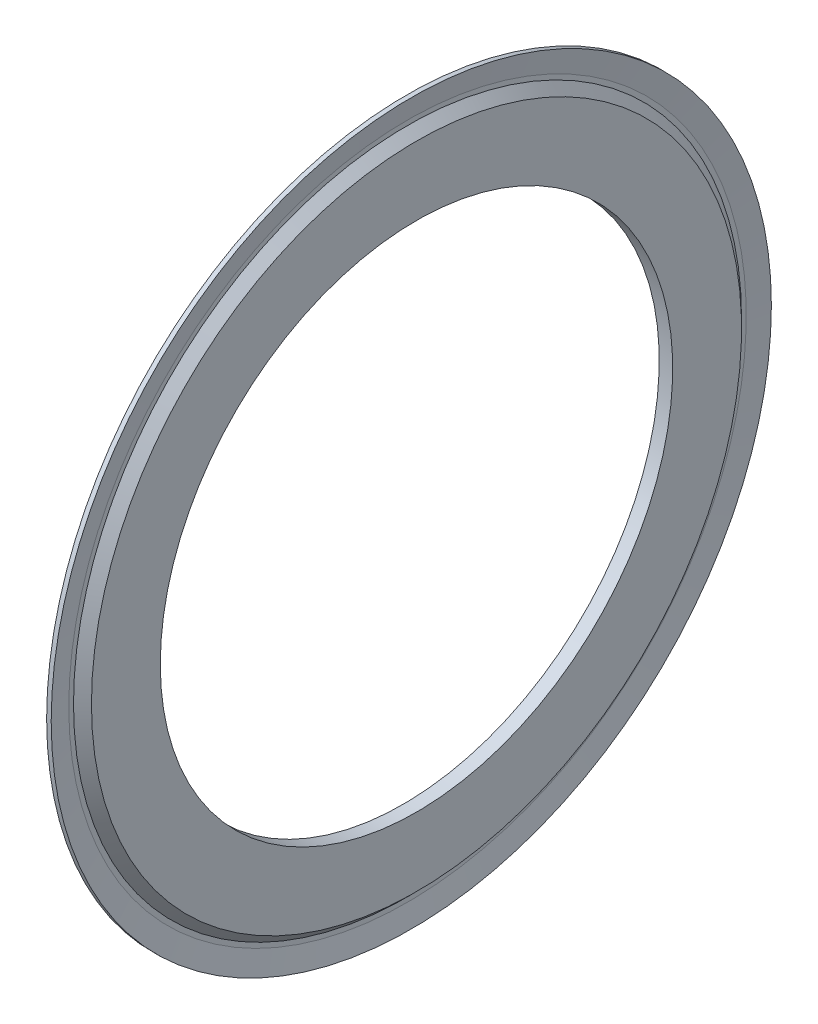
ISO-10303-21;
HEADER;
FILE_DESCRIPTION(('STEP AP214'),'2;1');
FILE_NAME('part.step','',(''),(''),'','','');
FILE_SCHEMA(('AUTOMOTIVE_DESIGN { 1 0 10303 214 1 1 1 1 }'));
ENDSEC;
DATA;
#1=APPLICATION_CONTEXT('core data for automotive mechanical design processes');
#2=APPLICATION_PROTOCOL_DEFINITION('international standard','automotive_design',2000,#1);
#3=PRODUCT_CONTEXT('',#1,'mechanical');
#4=PRODUCT('Part','Part','',(#3));
#5=PRODUCT_RELATED_PRODUCT_CATEGORY('part','',(#4));
#6=PRODUCT_DEFINITION_FORMATION('','',#4);
#7=PRODUCT_DEFINITION_CONTEXT('part definition',#1,'design');
#8=PRODUCT_DEFINITION('design','',#6,#7);
#9=PRODUCT_DEFINITION_SHAPE('','',#8);
#10=(LENGTH_UNIT() NAMED_UNIT(*) SI_UNIT(.MILLI.,.METRE.));
#11=(NAMED_UNIT(*) PLANE_ANGLE_UNIT() SI_UNIT($,.RADIAN.));
#12=(NAMED_UNIT(*) SI_UNIT($,.STERADIAN.) SOLID_ANGLE_UNIT());
#13=UNCERTAINTY_MEASURE_WITH_UNIT(LENGTH_MEASURE(1.E-05),#10,'distance_accuracy_value','');
#14=(GEOMETRIC_REPRESENTATION_CONTEXT(3) GLOBAL_UNCERTAINTY_ASSIGNED_CONTEXT((#13)) GLOBAL_UNIT_ASSIGNED_CONTEXT((#10,
#11,#12)) REPRESENTATION_CONTEXT('',''));
#15=CARTESIAN_POINT('',(0.,0.,0.));
#16=DIRECTION('',(0.,0.,1.));
#17=DIRECTION('',(1.,0.,0.));
#18=AXIS2_PLACEMENT_3D('',#15,#16,#17);
#19=CARTESIAN_POINT('',(4.64790554669992,0.,0.));
#20=DIRECTION('',(1.,0.,0.));
#21=DIRECTION('',(0.,0.,-1.));
#22=AXIS2_PLACEMENT_3D('',#19,#20,#21);
#23=CONICAL_SURFACE('',#22,6.8,1.39626340159546);
#24=CARTESIAN_POINT('',(4.72196287859748,0.,0.));
#25=DIRECTION('',(-1.,0.,0.));
#26=DIRECTION('',(0.,0.,1.));
#27=AXIS2_PLACEMENT_3D('',#24,#25,#26);
#28=CIRCLE('',#27,7.22);
#29=CARTESIAN_POINT('',(4.72196287859748,0.,7.22));
#30=VERTEX_POINT('',#29);
#31=EDGE_CURVE('E71',#30,#30,#28,.T.);
#32=ORIENTED_EDGE('',*,*,#31,.T.);
#33=EDGE_LOOP('',(#32));
#34=FACE_BOUND('',#33,.T.);
#35=CARTESIAN_POINT('',(4.64790554669992,0.,0.));
#36=DIRECTION('',(-1.,0.,0.));
#37=DIRECTION('',(0.,0.,1.));
#38=AXIS2_PLACEMENT_3D('',#35,#36,#37);
#39=CIRCLE('',#38,6.8);
#40=CARTESIAN_POINT('',(4.64790554669992,0.,6.8));
#41=VERTEX_POINT('',#40);
#42=EDGE_CURVE('E10',#41,#41,#39,.T.);
#43=ORIENTED_EDGE('',*,*,#42,.F.);
#44=EDGE_LOOP('',(#43));
#45=FACE_BOUND('',#44,.T.);
#46=ADVANCED_FACE('F14',(#34,#45),#23,.T.);
#47=CARTESIAN_POINT('',(4.64790554669992,6.8,0.));
#48=DIRECTION('',(1.,0.,0.));
#49=DIRECTION('',(0.,0.,-1.));
#50=AXIS2_PLACEMENT_3D('',#47,#48,#49);
#51=PLANE('',#50);
#52=CARTESIAN_POINT('',(4.64790554669992,0.,0.));
#53=DIRECTION('',(-1.,0.,0.));
#54=DIRECTION('',(0.,0.,1.));
#55=AXIS2_PLACEMENT_3D('',#52,#53,#54);
#56=CIRCLE('',#55,6.66);
#57=CARTESIAN_POINT('',(4.64790554669992,0.,6.66));
#58=VERTEX_POINT('',#57);
#59=EDGE_CURVE('E21',#58,#58,#56,.T.);
#60=ORIENTED_EDGE('',*,*,#59,.F.);
#61=EDGE_LOOP('',(#60));
#62=FACE_BOUND('',#61,.T.);
#63=ORIENTED_EDGE('',*,*,#42,.T.);
#64=EDGE_LOOP('',(#63));
#65=FACE_BOUND('',#64,.T.);
#66=ADVANCED_FACE('F92',(#62,#65),#51,.F.);
#67=CARTESIAN_POINT('',(4.82790554669992,0.,0.));
#68=DIRECTION('',(-1.,0.,0.));
#69=DIRECTION('',(0.,0.,1.));
#70=AXIS2_PLACEMENT_3D('',#67,#68,#69);
#71=CONICAL_SURFACE('',#70,6.48,0.785398163397446);
#72=ORIENTED_EDGE('',*,*,#59,.T.);
#73=EDGE_LOOP('',(#72));
#74=FACE_BOUND('',#73,.T.);
#75=CARTESIAN_POINT('',(4.82790554669992,0.,0.));
#76=DIRECTION('',(-1.,0.,0.));
#77=DIRECTION('',(0.,0.,1.));
#78=AXIS2_PLACEMENT_3D('',#75,#76,#77);
#79=CIRCLE('',#78,6.48);
#80=CARTESIAN_POINT('',(4.82790554669992,0.,6.48));
#81=VERTEX_POINT('',#80);
#82=EDGE_CURVE('E30',#81,#81,#79,.T.);
#83=ORIENTED_EDGE('',*,*,#82,.F.);
#84=EDGE_LOOP('',(#83));
#85=FACE_BOUND('',#84,.T.);
#86=ADVANCED_FACE('F96',(#74,#85),#71,.F.);
#87=CARTESIAN_POINT('',(4.82790554669992,5.2275,0.));
#88=DIRECTION('',(-1.,0.,0.));
#89=DIRECTION('',(0.,0.,1.));
#90=AXIS2_PLACEMENT_3D('',#87,#88,#89);
#91=PLANE('',#90);
#92=ORIENTED_EDGE('',*,*,#82,.T.);
#93=EDGE_LOOP('',(#92));
#94=FACE_BOUND('',#93,.T.);
#95=CARTESIAN_POINT('',(4.82790554669992,0.,0.));
#96=DIRECTION('',(-1.,0.,0.));
#97=DIRECTION('',(0.,0.,1.));
#98=AXIS2_PLACEMENT_3D('',#95,#96,#97);
#99=CIRCLE('',#98,5.2275);
#100=CARTESIAN_POINT('',(4.82790554669992,0.,5.2275));
#101=VERTEX_POINT('',#100);
#102=EDGE_CURVE('E37',#101,#101,#99,.T.);
#103=ORIENTED_EDGE('',*,*,#102,.F.);
#104=EDGE_LOOP('',(#103));
#105=FACE_BOUND('',#104,.T.);
#106=ADVANCED_FACE('F101',(#94,#105),#91,.T.);
#107=CARTESIAN_POINT('',(4.64790554669992,0.,0.));
#108=DIRECTION('',(-1.,0.,0.));
#109=DIRECTION('',(0.,0.,1.));
#110=AXIS2_PLACEMENT_3D('',#107,#108,#109);
#111=CYLINDRICAL_SURFACE('',#110,5.2275);
#112=ORIENTED_EDGE('',*,*,#102,.T.);
#113=EDGE_LOOP('',(#112));
#114=FACE_BOUND('',#113,.T.);
#115=CARTESIAN_POINT('',(4.64790554669992,0.,0.));
#116=DIRECTION('',(-1.,0.,0.));
#117=DIRECTION('',(0.,0.,1.));
#118=AXIS2_PLACEMENT_3D('',#115,#116,#117);
#119=CIRCLE('',#118,5.2275);
#120=CARTESIAN_POINT('',(4.64790554669992,0.,5.2275));
#121=VERTEX_POINT('',#120);
#122=EDGE_CURVE('E43',#121,#121,#119,.T.);
#123=ORIENTED_EDGE('',*,*,#122,.F.);
#124=EDGE_LOOP('',(#123));
#125=FACE_BOUND('',#124,.T.);
#126=ADVANCED_FACE('F106',(#114,#125),#111,.T.);
#127=CARTESIAN_POINT('',(4.64790554669992,5.1375,0.));
#128=DIRECTION('',(-1.,0.,0.));
#129=DIRECTION('',(0.,0.,1.));
#130=AXIS2_PLACEMENT_3D('',#127,#128,#129);
#131=PLANE('',#130);
#132=ORIENTED_EDGE('',*,*,#122,.T.);
#133=EDGE_LOOP('',(#132));
#134=FACE_BOUND('',#133,.T.);
#135=CARTESIAN_POINT('',(4.64790554669992,0.,0.));
#136=DIRECTION('',(-1.,0.,0.));
#137=DIRECTION('',(0.,0.,1.));
#138=AXIS2_PLACEMENT_3D('',#135,#136,#137);
#139=CIRCLE('',#138,5.1375);
#140=CARTESIAN_POINT('',(4.64790554669992,0.,5.1375));
#141=VERTEX_POINT('',#140);
#142=EDGE_CURVE('E47',#141,#141,#139,.T.);
#143=ORIENTED_EDGE('',*,*,#142,.F.);
#144=EDGE_LOOP('',(#143));
#145=FACE_BOUND('',#144,.T.);
#146=ADVANCED_FACE('F110',(#134,#145),#131,.T.);
#147=CARTESIAN_POINT('',(4.64790554669992,0.,0.));
#148=DIRECTION('',(-1.,0.,0.));
#149=DIRECTION('',(0.,0.,1.));
#150=AXIS2_PLACEMENT_3D('',#147,#148,#149);
#151=CYLINDRICAL_SURFACE('',#150,5.1375);
#152=CARTESIAN_POINT('',(4.91790554669992,0.,0.));
#153=DIRECTION('',(-1.,0.,0.));
#154=DIRECTION('',(0.,0.,1.));
#155=AXIS2_PLACEMENT_3D('',#152,#153,#154);
#156=CIRCLE('',#155,5.1375);
#157=CARTESIAN_POINT('',(4.91790554669992,0.,5.1375));
#158=VERTEX_POINT('',#157);
#159=EDGE_CURVE('E51',#158,#158,#156,.T.);
#160=ORIENTED_EDGE('',*,*,#159,.F.);
#161=EDGE_LOOP('',(#160));
#162=FACE_BOUND('',#161,.T.);
#163=ORIENTED_EDGE('',*,*,#142,.T.);
#164=EDGE_LOOP('',(#163));
#165=FACE_BOUND('',#164,.T.);
#166=ADVANCED_FACE('F114',(#162,#165),#151,.F.);
#167=CARTESIAN_POINT('',(4.91790554669992,5.1375,0.));
#168=DIRECTION('',(-1.,0.,0.));
#169=DIRECTION('',(0.,0.,1.));
#170=AXIS2_PLACEMENT_3D('',#167,#168,#169);
#171=PLANE('',#170);
#172=CARTESIAN_POINT('',(4.91790554669992,0.,0.));
#173=DIRECTION('',(-1.,0.,0.));
#174=DIRECTION('',(0.,0.,1.));
#175=AXIS2_PLACEMENT_3D('',#172,#173,#174);
#176=CIRCLE('',#175,6.51727922061358);
#177=CARTESIAN_POINT('',(4.91790554669992,0.,6.51727922061358));
#178=VERTEX_POINT('',#177);
#179=EDGE_CURVE('E55',#178,#178,#176,.T.);
#180=ORIENTED_EDGE('',*,*,#179,.F.);
#181=EDGE_LOOP('',(#180));
#182=FACE_BOUND('',#181,.T.);
#183=ORIENTED_EDGE('',*,*,#159,.T.);
#184=EDGE_LOOP('',(#183));
#185=FACE_BOUND('',#184,.T.);
#186=ADVANCED_FACE('F118',(#182,#185),#171,.F.);
#187=CARTESIAN_POINT('',(4.91790554669992,0.,0.));
#188=DIRECTION('',(-1.,0.,0.));
#189=DIRECTION('',(0.,0.,1.));
#190=AXIS2_PLACEMENT_3D('',#187,#188,#189);
#191=CONICAL_SURFACE('',#190,6.51727922061358,0.785398163397443);
#192=CARTESIAN_POINT('',(4.73790554669992,0.,0.));
#193=DIRECTION('',(-1.,0.,0.));
#194=DIRECTION('',(0.,0.,1.));
#195=AXIS2_PLACEMENT_3D('',#192,#193,#194);
#196=CIRCLE('',#195,6.69727922061358);
#197=CARTESIAN_POINT('',(4.73790554669992,0.,6.69727922061358));
#198=VERTEX_POINT('',#197);
#199=EDGE_CURVE('E59',#198,#198,#196,.T.);
#200=ORIENTED_EDGE('',*,*,#199,.F.);
#201=EDGE_LOOP('',(#200));
#202=FACE_BOUND('',#201,.T.);
#203=ORIENTED_EDGE('',*,*,#179,.T.);
#204=EDGE_LOOP('',(#203));
#205=FACE_BOUND('',#204,.T.);
#206=ADVANCED_FACE('F122',(#202,#205),#191,.T.);
#207=CARTESIAN_POINT('',(4.73790554669992,6.69727922061358,0.));
#208=DIRECTION('',(-1.,0.,0.));
#209=DIRECTION('',(0.,0.,1.));
#210=AXIS2_PLACEMENT_3D('',#207,#208,#209);
#211=PLANE('',#210);
#212=CARTESIAN_POINT('',(4.73790554669992,0.,0.));
#213=DIRECTION('',(-1.,0.,0.));
#214=DIRECTION('',(0.,0.,1.));
#215=AXIS2_PLACEMENT_3D('',#212,#213,#214);
#216=CIRCLE('',#215,6.79212602028267);
#217=CARTESIAN_POINT('',(4.73790554669992,0.,6.79212602028267));
#218=VERTEX_POINT('',#217);
#219=EDGE_CURVE('E63',#218,#218,#216,.T.);
#220=ORIENTED_EDGE('',*,*,#219,.F.);
#221=EDGE_LOOP('',(#220));
#222=FACE_BOUND('',#221,.T.);
#223=ORIENTED_EDGE('',*,*,#199,.T.);
#224=EDGE_LOOP('',(#223));
#225=FACE_BOUND('',#224,.T.);
#226=ADVANCED_FACE('F88',(#222,#225),#211,.F.);
#227=CARTESIAN_POINT('',(4.73790554669992,0.,0.));
#228=DIRECTION('',(1.,0.,0.));
#229=DIRECTION('',(0.,0.,-1.));
#230=AXIS2_PLACEMENT_3D('',#227,#228,#229);
#231=CONICAL_SURFACE('',#230,6.79212602028267,1.39626340159546);
#232=CARTESIAN_POINT('',(4.81335127366719,0.,0.));
#233=DIRECTION('',(-1.,0.,0.));
#234=DIRECTION('',(0.,0.,1.));
#235=AXIS2_PLACEMENT_3D('',#232,#233,#234);
#236=CIRCLE('',#235,7.22);
#237=CARTESIAN_POINT('',(4.81335127366719,0.,7.22));
#238=VERTEX_POINT('',#237);
#239=EDGE_CURVE('E67',#238,#238,#236,.T.);
#240=ORIENTED_EDGE('',*,*,#239,.F.);
#241=EDGE_LOOP('',(#240));
#242=FACE_BOUND('',#241,.T.);
#243=ORIENTED_EDGE('',*,*,#219,.T.);
#244=EDGE_LOOP('',(#243));
#245=FACE_BOUND('',#244,.T.);
#246=ADVANCED_FACE('F81',(#242,#245),#231,.F.);
#247=CARTESIAN_POINT('',(4.64790554669992,0.,0.));
#248=DIRECTION('',(-1.,0.,0.));
#249=DIRECTION('',(0.,0.,1.));
#250=AXIS2_PLACEMENT_3D('',#247,#248,#249);
#251=CYLINDRICAL_SURFACE('',#250,7.22);
#252=ORIENTED_EDGE('',*,*,#239,.T.);
#253=EDGE_LOOP('',(#252));
#254=FACE_BOUND('',#253,.T.);
#255=ORIENTED_EDGE('',*,*,#31,.F.);
#256=EDGE_LOOP('',(#255));
#257=FACE_BOUND('',#256,.T.);
#258=ADVANCED_FACE('F79',(#254,#257),#251,.T.);
#259=CLOSED_SHELL('',(#46,#66,#86,#106,#126,#146,#166,#186,#206,#226,#246,#258));
#260=MANIFOLD_SOLID_BREP('B1',#259);
#261=ADVANCED_BREP_SHAPE_REPRESENTATION('',(#18,#260),#14);
#262=SHAPE_DEFINITION_REPRESENTATION(#9,#261);
ENDSEC;
END-ISO-10303-21;
